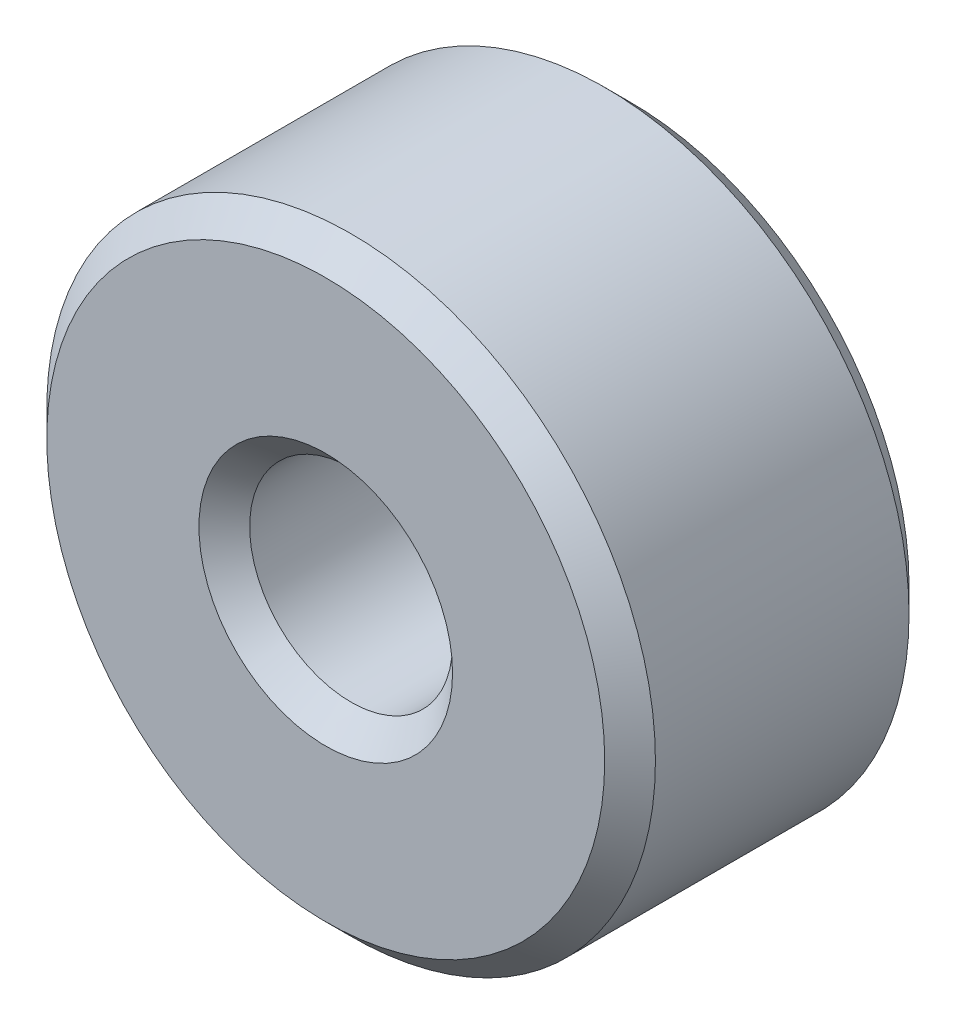
ISO-10303-21;
HEADER;
FILE_DESCRIPTION(('STEP AP214'),'2;1');
FILE_NAME('part.step','',(''),(''),'','','');
FILE_SCHEMA(('AUTOMOTIVE_DESIGN { 1 0 10303 214 1 1 1 1 }'));
ENDSEC;
DATA;
#1=APPLICATION_CONTEXT('core data for automotive mechanical design processes');
#2=APPLICATION_PROTOCOL_DEFINITION('international standard','automotive_design',2000,#1);
#3=PRODUCT_CONTEXT('',#1,'mechanical');
#4=PRODUCT('Part','Part','',(#3));
#5=PRODUCT_RELATED_PRODUCT_CATEGORY('part','',(#4));
#6=PRODUCT_DEFINITION_FORMATION('','',#4);
#7=PRODUCT_DEFINITION_CONTEXT('part definition',#1,'design');
#8=PRODUCT_DEFINITION('design','',#6,#7);
#9=PRODUCT_DEFINITION_SHAPE('','',#8);
#10=(LENGTH_UNIT() NAMED_UNIT(*) SI_UNIT(.MILLI.,.METRE.));
#11=(NAMED_UNIT(*) PLANE_ANGLE_UNIT() SI_UNIT($,.RADIAN.));
#12=(NAMED_UNIT(*) SI_UNIT($,.STERADIAN.) SOLID_ANGLE_UNIT());
#13=UNCERTAINTY_MEASURE_WITH_UNIT(LENGTH_MEASURE(1.E-05),#10,'distance_accuracy_value','');
#14=(GEOMETRIC_REPRESENTATION_CONTEXT(3) GLOBAL_UNCERTAINTY_ASSIGNED_CONTEXT((#13)) GLOBAL_UNIT_ASSIGNED_CONTEXT((#10,
#11,#12)) REPRESENTATION_CONTEXT('',''));
#15=CARTESIAN_POINT('',(0.,0.,0.));
#16=DIRECTION('',(0.,0.,1.));
#17=DIRECTION('',(1.,0.,0.));
#18=AXIS2_PLACEMENT_3D('',#15,#16,#17);
#19=CARTESIAN_POINT('',(0.,0.,3.));
#20=DIRECTION('',(0.,0.,1.));
#21=DIRECTION('',(1.,0.,0.));
#22=AXIS2_PLACEMENT_3D('',#19,#20,#21);
#23=PLANE('',#22);
#24=CARTESIAN_POINT('',(0.,0.,3.));
#25=DIRECTION('',(0.,0.,1.));
#26=DIRECTION('',(1.,0.,0.));
#27=AXIS2_PLACEMENT_3D('',#24,#25,#26);
#28=CIRCLE('',#27,1.25);
#29=CARTESIAN_POINT('',(1.25,0.,3.));
#30=VERTEX_POINT('',#29);
#31=EDGE_CURVE('E11',#30,#30,#28,.F.);
#32=ORIENTED_EDGE('',*,*,#31,.T.);
#33=EDGE_LOOP('',(#32));
#34=FACE_BOUND('',#33,.T.);
#35=CARTESIAN_POINT('',(0.,0.,3.));
#36=DIRECTION('',(0.,0.,1.));
#37=DIRECTION('',(1.,0.,0.));
#38=AXIS2_PLACEMENT_3D('',#35,#36,#37);
#39=CIRCLE('',#38,2.75);
#40=CARTESIAN_POINT('',(2.75,0.,3.));
#41=VERTEX_POINT('',#40);
#42=EDGE_CURVE('E45',#41,#41,#39,.T.);
#43=ORIENTED_EDGE('',*,*,#42,.T.);
#44=EDGE_LOOP('',(#43));
#45=FACE_BOUND('',#44,.T.);
#46=ADVANCED_FACE('F38',(#34,#45),#23,.T.);
#47=CARTESIAN_POINT('',(0.,0.,0.));
#48=DIRECTION('',(0.,0.,1.));
#49=DIRECTION('',(1.,0.,0.));
#50=AXIS2_PLACEMENT_3D('',#47,#48,#49);
#51=PLANE('',#50);
#52=CARTESIAN_POINT('',(0.,0.,0.));
#53=DIRECTION('',(0.,0.,1.));
#54=DIRECTION('',(1.,0.,0.));
#55=AXIS2_PLACEMENT_3D('',#52,#53,#54);
#56=CIRCLE('',#55,1.25);
#57=CARTESIAN_POINT('',(1.25,0.,0.));
#58=VERTEX_POINT('',#57);
#59=EDGE_CURVE('E64',#58,#58,#56,.T.);
#60=ORIENTED_EDGE('',*,*,#59,.T.);
#61=EDGE_LOOP('',(#60));
#62=FACE_BOUND('',#61,.T.);
#63=CARTESIAN_POINT('',(0.,0.,0.));
#64=DIRECTION('',(0.,0.,1.));
#65=DIRECTION('',(1.,0.,0.));
#66=AXIS2_PLACEMENT_3D('',#63,#64,#65);
#67=CIRCLE('',#66,2.75);
#68=CARTESIAN_POINT('',(2.75,0.,0.));
#69=VERTEX_POINT('',#68);
#70=EDGE_CURVE('E67',#69,#69,#67,.F.);
#71=ORIENTED_EDGE('',*,*,#70,.T.);
#72=EDGE_LOOP('',(#71));
#73=FACE_BOUND('',#72,.T.);
#74=ADVANCED_FACE('F71',(#62,#73),#51,.F.);
#75=CARTESIAN_POINT('',(0.,0.,3.));
#76=DIRECTION('',(0.,0.,-1.));
#77=DIRECTION('',(-1.,0.,0.));
#78=AXIS2_PLACEMENT_3D('',#75,#76,#77);
#79=CYLINDRICAL_SURFACE('',#78,3.);
#80=CARTESIAN_POINT('',(0.,0.,0.250000000000001));
#81=DIRECTION('',(0.,0.,1.));
#82=DIRECTION('',(1.,0.,0.));
#83=AXIS2_PLACEMENT_3D('',#80,#81,#82);
#84=CIRCLE('',#83,3.);
#85=CARTESIAN_POINT('',(3.,0.,0.250000000000001));
#86=VERTEX_POINT('',#85);
#87=EDGE_CURVE('E49',#86,#86,#84,.T.);
#88=ORIENTED_EDGE('',*,*,#87,.T.);
#89=EDGE_LOOP('',(#88));
#90=FACE_BOUND('',#89,.T.);
#91=CARTESIAN_POINT('',(0.,0.,2.75));
#92=DIRECTION('',(0.,0.,1.));
#93=DIRECTION('',(1.,0.,0.));
#94=AXIS2_PLACEMENT_3D('',#91,#92,#93);
#95=CIRCLE('',#94,3.);
#96=CARTESIAN_POINT('',(3.,0.,2.75));
#97=VERTEX_POINT('',#96);
#98=EDGE_CURVE('E53',#97,#97,#95,.F.);
#99=ORIENTED_EDGE('',*,*,#98,.T.);
#100=EDGE_LOOP('',(#99));
#101=FACE_BOUND('',#100,.T.);
#102=ADVANCED_FACE('F81',(#90,#101),#79,.T.);
#103=CARTESIAN_POINT('',(0.,0.,3.));
#104=DIRECTION('',(0.,0.,-1.));
#105=DIRECTION('',(-1.,0.,0.));
#106=AXIS2_PLACEMENT_3D('',#103,#104,#105);
#107=CYLINDRICAL_SURFACE('',#106,1.);
#108=CARTESIAN_POINT('',(0.,0.,0.250000000000001));
#109=DIRECTION('',(0.,0.,1.));
#110=DIRECTION('',(1.,0.,0.));
#111=AXIS2_PLACEMENT_3D('',#108,#109,#110);
#112=CIRCLE('',#111,1.);
#113=CARTESIAN_POINT('',(1.,0.,0.250000000000001));
#114=VERTEX_POINT('',#113);
#115=EDGE_CURVE('E58',#114,#114,#112,.F.);
#116=ORIENTED_EDGE('',*,*,#115,.T.);
#117=EDGE_LOOP('',(#116));
#118=FACE_BOUND('',#117,.T.);
#119=CARTESIAN_POINT('',(0.,0.,2.75));
#120=DIRECTION('',(0.,0.,1.));
#121=DIRECTION('',(1.,0.,0.));
#122=AXIS2_PLACEMENT_3D('',#119,#120,#121);
#123=CIRCLE('',#122,1.);
#124=CARTESIAN_POINT('',(1.,0.,2.75));
#125=VERTEX_POINT('',#124);
#126=EDGE_CURVE('E61',#125,#125,#123,.T.);
#127=ORIENTED_EDGE('',*,*,#126,.T.);
#128=EDGE_LOOP('',(#127));
#129=FACE_BOUND('',#128,.T.);
#130=ADVANCED_FACE('F84',(#118,#129),#107,.F.);
#131=CARTESIAN_POINT('',(0.,0.,0.));
#132=DIRECTION('',(0.,0.,-1.));
#133=DIRECTION('',(-1.,0.,0.));
#134=AXIS2_PLACEMENT_3D('',#131,#132,#133);
#135=CONICAL_SURFACE('',#134,1.25,0.785398163397445);
#136=ORIENTED_EDGE('',*,*,#115,.F.);
#137=EDGE_LOOP('',(#136));
#138=FACE_BOUND('',#137,.T.);
#139=ORIENTED_EDGE('',*,*,#59,.F.);
#140=EDGE_LOOP('',(#139));
#141=FACE_BOUND('',#140,.T.);
#142=ADVANCED_FACE('F77',(#138,#141),#135,.F.);
#143=CARTESIAN_POINT('',(0.,0.,0.250000000000001));
#144=DIRECTION('',(0.,0.,1.));
#145=DIRECTION('',(1.,0.,0.));
#146=AXIS2_PLACEMENT_3D('',#143,#144,#145);
#147=CONICAL_SURFACE('',#146,3.,0.785398163397451);
#148=ORIENTED_EDGE('',*,*,#70,.F.);
#149=EDGE_LOOP('',(#148));
#150=FACE_BOUND('',#149,.T.);
#151=ORIENTED_EDGE('',*,*,#87,.F.);
#152=EDGE_LOOP('',(#151));
#153=FACE_BOUND('',#152,.T.);
#154=ADVANCED_FACE('F73',(#150,#153),#147,.T.);
#155=CARTESIAN_POINT('',(0.,0.,2.75));
#156=DIRECTION('',(0.,0.,1.));
#157=DIRECTION('',(1.,0.,0.));
#158=AXIS2_PLACEMENT_3D('',#155,#156,#157);
#159=CONICAL_SURFACE('',#158,1.,0.78539816339745);
#160=ORIENTED_EDGE('',*,*,#31,.F.);
#161=EDGE_LOOP('',(#160));
#162=FACE_BOUND('',#161,.T.);
#163=ORIENTED_EDGE('',*,*,#126,.F.);
#164=EDGE_LOOP('',(#163));
#165=FACE_BOUND('',#164,.T.);
#166=ADVANCED_FACE('F76',(#162,#165),#159,.F.);
#167=CARTESIAN_POINT('',(0.,0.,3.));
#168=DIRECTION('',(0.,0.,-1.));
#169=DIRECTION('',(-1.,0.,0.));
#170=AXIS2_PLACEMENT_3D('',#167,#168,#169);
#171=CONICAL_SURFACE('',#170,2.75,0.785398163397447);
#172=ORIENTED_EDGE('',*,*,#98,.F.);
#173=EDGE_LOOP('',(#172));
#174=FACE_BOUND('',#173,.T.);
#175=ORIENTED_EDGE('',*,*,#42,.F.);
#176=EDGE_LOOP('',(#175));
#177=FACE_BOUND('',#176,.T.);
#178=ADVANCED_FACE('F40',(#174,#177),#171,.T.);
#179=CLOSED_SHELL('',(#46,#74,#102,#130,#142,#154,#166,#178));
#180=MANIFOLD_SOLID_BREP('B2',#179);
#181=ADVANCED_BREP_SHAPE_REPRESENTATION('',(#18,#180),#14);
#182=SHAPE_DEFINITION_REPRESENTATION(#9,#181);
ENDSEC;
END-ISO-10303-21;
